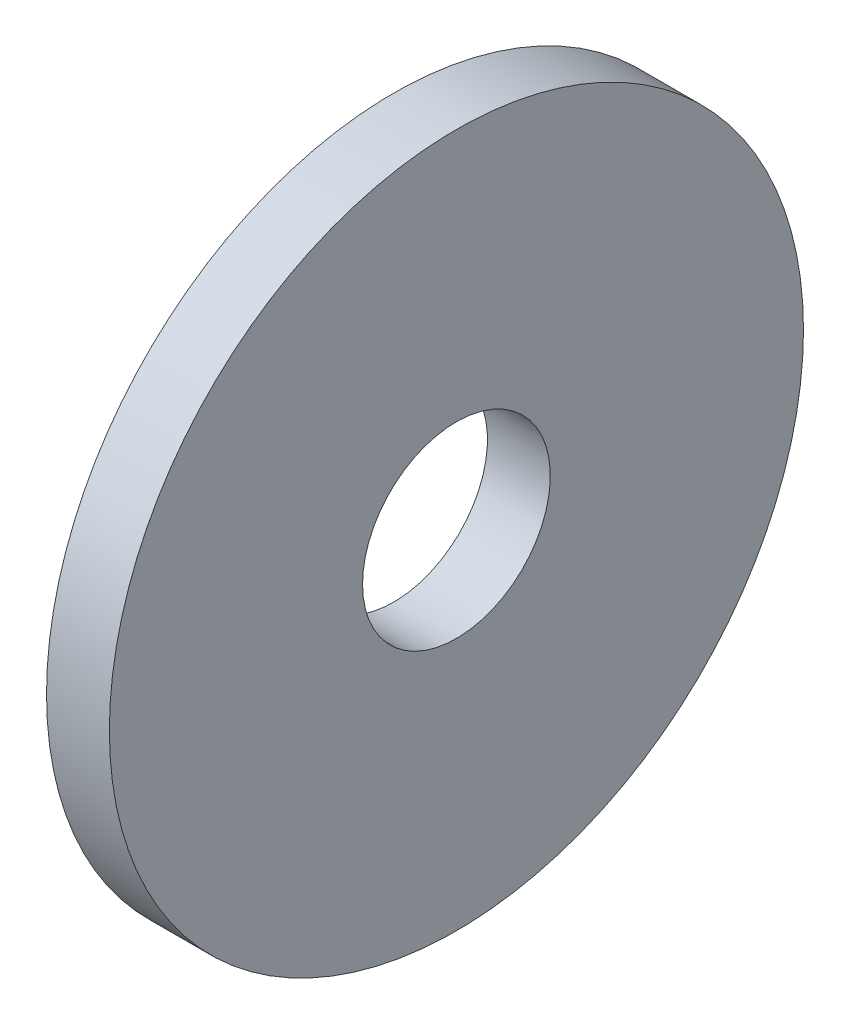
ISO-10303-21;
HEADER;
FILE_DESCRIPTION(('STEP AP214'),'2;1');
FILE_NAME('part.step','',(''),(''),'','','');
FILE_SCHEMA(('AUTOMOTIVE_DESIGN { 1 0 10303 214 1 1 1 1 }'));
ENDSEC;
DATA;
#1=APPLICATION_CONTEXT('core data for automotive mechanical design processes');
#2=APPLICATION_PROTOCOL_DEFINITION('international standard','automotive_design',2000,#1);
#3=PRODUCT_CONTEXT('',#1,'mechanical');
#4=PRODUCT('Part','Part','',(#3));
#5=PRODUCT_RELATED_PRODUCT_CATEGORY('part','',(#4));
#6=PRODUCT_DEFINITION_FORMATION('','',#4);
#7=PRODUCT_DEFINITION_CONTEXT('part definition',#1,'design');
#8=PRODUCT_DEFINITION('design','',#6,#7);
#9=PRODUCT_DEFINITION_SHAPE('','',#8);
#10=(LENGTH_UNIT() NAMED_UNIT(*) SI_UNIT(.MILLI.,.METRE.));
#11=(NAMED_UNIT(*) PLANE_ANGLE_UNIT() SI_UNIT($,.RADIAN.));
#12=(NAMED_UNIT(*) SI_UNIT($,.STERADIAN.) SOLID_ANGLE_UNIT());
#13=UNCERTAINTY_MEASURE_WITH_UNIT(LENGTH_MEASURE(1.E-05),#10,'distance_accuracy_value','');
#14=(GEOMETRIC_REPRESENTATION_CONTEXT(3) GLOBAL_UNCERTAINTY_ASSIGNED_CONTEXT((#13)) GLOBAL_UNIT_ASSIGNED_CONTEXT((#10,
#11,#12)) REPRESENTATION_CONTEXT('',''));
#15=CARTESIAN_POINT('',(0.,0.,0.));
#16=DIRECTION('',(0.,0.,1.));
#17=DIRECTION('',(1.,0.,0.));
#18=AXIS2_PLACEMENT_3D('',#15,#16,#17);
#19=CARTESIAN_POINT('',(-34.9249999999999,0.,0.));
#20=DIRECTION('',(-1.,0.,0.));
#21=DIRECTION('',(0.,0.,1.));
#22=AXIS2_PLACEMENT_3D('',#19,#20,#21);
#23=CYLINDRICAL_SURFACE('',#22,3.435);
#24=CARTESIAN_POINT('',(0.,0.,0.));
#25=DIRECTION('',(-1.,0.,0.));
#26=DIRECTION('',(0.,0.,1.));
#27=AXIS2_PLACEMENT_3D('',#24,#25,#26);
#28=CIRCLE('',#27,3.435);
#29=CARTESIAN_POINT('',(0.,0.,3.435));
#30=VERTEX_POINT('',#29);
#31=EDGE_CURVE('E10',#30,#30,#28,.T.);
#32=ORIENTED_EDGE('',*,*,#31,.F.);
#33=EDGE_LOOP('',(#32));
#34=FACE_BOUND('',#33,.T.);
#35=CARTESIAN_POINT('',(-2.3,0.,0.));
#36=DIRECTION('',(-1.,0.,0.));
#37=DIRECTION('',(0.,0.,1.));
#38=AXIS2_PLACEMENT_3D('',#35,#36,#37);
#39=CIRCLE('',#38,3.435);
#40=CARTESIAN_POINT('',(-2.3,0.,3.435));
#41=VERTEX_POINT('',#40);
#42=EDGE_CURVE('E43',#41,#41,#39,.T.);
#43=ORIENTED_EDGE('',*,*,#42,.T.);
#44=EDGE_LOOP('',(#43));
#45=FACE_BOUND('',#44,.T.);
#46=ADVANCED_FACE('F29',(#34,#45),#23,.F.);
#47=CARTESIAN_POINT('',(0.,3.435,0.));
#48=DIRECTION('',(-1.,0.,0.));
#49=DIRECTION('',(0.,0.,1.));
#50=AXIS2_PLACEMENT_3D('',#47,#48,#49);
#51=PLANE('',#50);
#52=CARTESIAN_POINT('',(0.,0.,0.));
#53=DIRECTION('',(-1.,0.,0.));
#54=DIRECTION('',(0.,0.,1.));
#55=AXIS2_PLACEMENT_3D('',#52,#53,#54);
#56=CIRCLE('',#55,12.7);
#57=CARTESIAN_POINT('',(0.,0.,12.7));
#58=VERTEX_POINT('',#57);
#59=EDGE_CURVE('E35',#58,#58,#56,.T.);
#60=ORIENTED_EDGE('',*,*,#59,.F.);
#61=EDGE_LOOP('',(#60));
#62=FACE_BOUND('',#61,.T.);
#63=ORIENTED_EDGE('',*,*,#31,.T.);
#64=EDGE_LOOP('',(#63));
#65=FACE_BOUND('',#64,.T.);
#66=ADVANCED_FACE('F58',(#62,#65),#51,.F.);
#67=CARTESIAN_POINT('',(-34.9249999999999,0.,0.));
#68=DIRECTION('',(-1.,0.,0.));
#69=DIRECTION('',(0.,0.,1.));
#70=AXIS2_PLACEMENT_3D('',#67,#68,#69);
#71=CYLINDRICAL_SURFACE('',#70,12.7);
#72=CARTESIAN_POINT('',(-2.3,0.,0.));
#73=DIRECTION('',(-1.,0.,0.));
#74=DIRECTION('',(0.,0.,1.));
#75=AXIS2_PLACEMENT_3D('',#72,#73,#74);
#76=CIRCLE('',#75,12.7);
#77=CARTESIAN_POINT('',(-2.3,0.,12.7));
#78=VERTEX_POINT('',#77);
#79=EDGE_CURVE('E39',#78,#78,#76,.T.);
#80=ORIENTED_EDGE('',*,*,#79,.F.);
#81=EDGE_LOOP('',(#80));
#82=FACE_BOUND('',#81,.T.);
#83=ORIENTED_EDGE('',*,*,#59,.T.);
#84=EDGE_LOOP('',(#83));
#85=FACE_BOUND('',#84,.T.);
#86=ADVANCED_FACE('F53',(#82,#85),#71,.T.);
#87=CARTESIAN_POINT('',(-2.3,12.7,0.));
#88=DIRECTION('',(1.,0.,0.));
#89=DIRECTION('',(0.,0.,-1.));
#90=AXIS2_PLACEMENT_3D('',#87,#88,#89);
#91=PLANE('',#90);
#92=ORIENTED_EDGE('',*,*,#42,.F.);
#93=EDGE_LOOP('',(#92));
#94=FACE_BOUND('',#93,.T.);
#95=ORIENTED_EDGE('',*,*,#79,.T.);
#96=EDGE_LOOP('',(#95));
#97=FACE_BOUND('',#96,.T.);
#98=ADVANCED_FACE('F50',(#94,#97),#91,.F.);
#99=CLOSED_SHELL('',(#46,#66,#86,#98));
#100=MANIFOLD_SOLID_BREP('B2',#99);
#101=ADVANCED_BREP_SHAPE_REPRESENTATION('',(#18,#100),#14);
#102=SHAPE_DEFINITION_REPRESENTATION(#9,#101);
ENDSEC;
END-ISO-10303-21;
